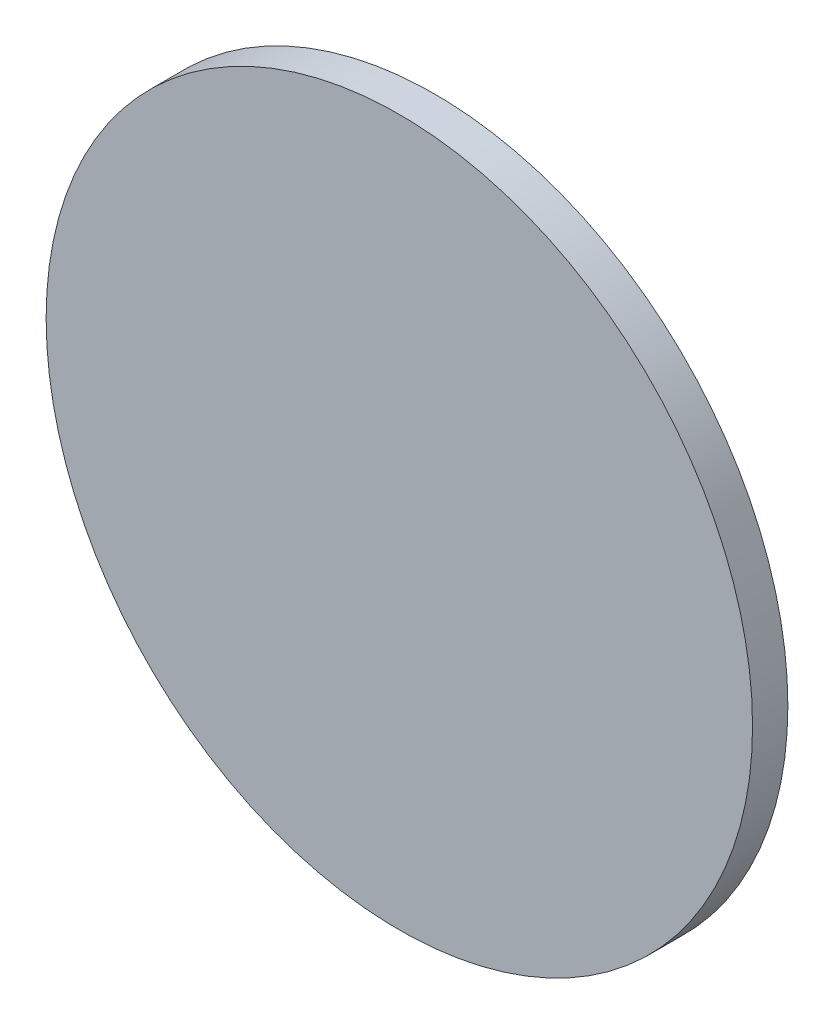
ISO-10303-21;
HEADER;
FILE_DESCRIPTION(('STEP AP214'),'2;1');
FILE_NAME('part.step','',(''),(''),'','','');
FILE_SCHEMA(('AUTOMOTIVE_DESIGN { 1 0 10303 214 1 1 1 1 }'));
ENDSEC;
DATA;
#1=APPLICATION_CONTEXT('core data for automotive mechanical design processes');
#2=APPLICATION_PROTOCOL_DEFINITION('international standard','automotive_design',2000,#1);
#3=PRODUCT_CONTEXT('',#1,'mechanical');
#4=PRODUCT('Part','Part','',(#3));
#5=PRODUCT_RELATED_PRODUCT_CATEGORY('part','',(#4));
#6=PRODUCT_DEFINITION_FORMATION('','',#4);
#7=PRODUCT_DEFINITION_CONTEXT('part definition',#1,'design');
#8=PRODUCT_DEFINITION('design','',#6,#7);
#9=PRODUCT_DEFINITION_SHAPE('','',#8);
#10=(LENGTH_UNIT() NAMED_UNIT(*) SI_UNIT(.MILLI.,.METRE.));
#11=(NAMED_UNIT(*) PLANE_ANGLE_UNIT() SI_UNIT($,.RADIAN.));
#12=(NAMED_UNIT(*) SI_UNIT($,.STERADIAN.) SOLID_ANGLE_UNIT());
#13=UNCERTAINTY_MEASURE_WITH_UNIT(LENGTH_MEASURE(1.E-05),#10,'distance_accuracy_value','');
#14=(GEOMETRIC_REPRESENTATION_CONTEXT(3) GLOBAL_UNCERTAINTY_ASSIGNED_CONTEXT((#13)) GLOBAL_UNIT_ASSIGNED_CONTEXT((#10,
#11,#12)) REPRESENTATION_CONTEXT('',''));
#15=CARTESIAN_POINT('',(0.,0.,0.));
#16=DIRECTION('',(0.,0.,1.));
#17=DIRECTION('',(1.,0.,0.));
#18=AXIS2_PLACEMENT_3D('',#15,#16,#17);
#19=CARTESIAN_POINT('',(0.0999998,0.,0.00999998));
#20=DIRECTION('',(0.,0.,-1.));
#21=DIRECTION('',(0.,-1.,0.));
#22=AXIS2_PLACEMENT_3D('',#19,#20,#21);
#23=PLANE('',#22);
#24=CARTESIAN_POINT('',(0.,0.,0.00999998));
#25=DIRECTION('',(0.,0.,1.));
#26=DIRECTION('',(1.,0.,0.));
#27=AXIS2_PLACEMENT_3D('',#24,#25,#26);
#28=CIRCLE('',#27,0.0999998);
#29=CARTESIAN_POINT('',(0.0999998,0.,0.00999998));
#30=VERTEX_POINT('',#29);
#31=EDGE_CURVE('E11',#30,#30,#28,.T.);
#32=ORIENTED_EDGE('',*,*,#31,.T.);
#33=EDGE_LOOP('',(#32));
#34=FACE_BOUND('',#33,.T.);
#35=ADVANCED_FACE('F16',(#34),#23,.F.);
#36=CARTESIAN_POINT('',(0.0999998,0.,0.));
#37=DIRECTION('',(0.,0.,-1.));
#38=DIRECTION('',(0.,-1.,0.));
#39=AXIS2_PLACEMENT_3D('',#36,#37,#38);
#40=PLANE('',#39);
#41=CARTESIAN_POINT('',(0.,0.,0.));
#42=DIRECTION('',(0.,0.,1.));
#43=DIRECTION('',(1.,0.,0.));
#44=AXIS2_PLACEMENT_3D('',#41,#42,#43);
#45=CIRCLE('',#44,0.0999998);
#46=CARTESIAN_POINT('',(0.0999998,0.,0.));
#47=VERTEX_POINT('',#46);
#48=EDGE_CURVE('E19',#47,#47,#45,.T.);
#49=ORIENTED_EDGE('',*,*,#48,.F.);
#50=EDGE_LOOP('',(#49));
#51=FACE_BOUND('',#50,.T.);
#52=ADVANCED_FACE('F51',(#51),#40,.T.);
#53=CARTESIAN_POINT('',(0.,0.,0.));
#54=DIRECTION('',(0.,0.,-1.));
#55=DIRECTION('',(1.,0.,0.));
#56=AXIS2_PLACEMENT_3D('',#53,#54,#55);
#57=CYLINDRICAL_SURFACE('',#56,0.0999998);
#58=ORIENTED_EDGE('',*,*,#48,.T.);
#59=DIRECTION('',(0.,0.,1.));
#60=VECTOR('',#59,1.);
#61=CARTESIAN_POINT('',(0.0999998,0.,0.));
#62=LINE('',#61,#60);
#63=EDGE_CURVE('E25',#47,#30,#62,.T.);
#64=ORIENTED_EDGE('',*,*,#63,.T.);
#65=ORIENTED_EDGE('',*,*,#31,.F.);
#66=ORIENTED_EDGE('',*,*,#63,.F.);
#67=EDGE_LOOP('',(#58,#64,#65,#66));
#68=FACE_BOUND('',#67,.T.);
#69=ADVANCED_FACE('F40',(#68),#57,.T.);
#70=CLOSED_SHELL('',(#35,#52,#69));
#71=MANIFOLD_SOLID_BREP('B1',#70);
#72=ADVANCED_BREP_SHAPE_REPRESENTATION('',(#18,#71),#14);
#73=SHAPE_DEFINITION_REPRESENTATION(#9,#72);
ENDSEC;
END-ISO-10303-21;
